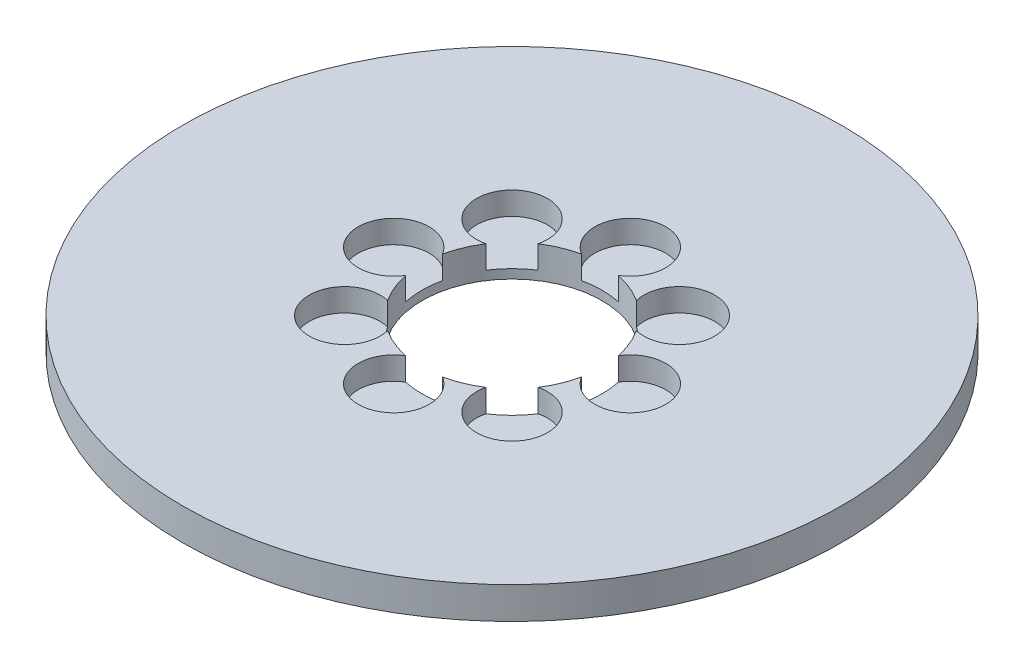
ISO-10303-21;
HEADER;
FILE_DESCRIPTION(('STEP AP214'),'2;1');
FILE_NAME('part.step','',(''),(''),'','','');
FILE_SCHEMA(('AUTOMOTIVE_DESIGN { 1 0 10303 214 1 1 1 1 }'));
ENDSEC;
DATA;
#1=APPLICATION_CONTEXT('core data for automotive mechanical design processes');
#2=APPLICATION_PROTOCOL_DEFINITION('international standard','automotive_design',2000,#1);
#3=PRODUCT_CONTEXT('',#1,'mechanical');
#4=PRODUCT('Part','Part','',(#3));
#5=PRODUCT_RELATED_PRODUCT_CATEGORY('part','',(#4));
#6=PRODUCT_DEFINITION_FORMATION('','',#4);
#7=PRODUCT_DEFINITION_CONTEXT('part definition',#1,'design');
#8=PRODUCT_DEFINITION('design','',#6,#7);
#9=PRODUCT_DEFINITION_SHAPE('','',#8);
#10=(LENGTH_UNIT() NAMED_UNIT(*) SI_UNIT(.MILLI.,.METRE.));
#11=(NAMED_UNIT(*) PLANE_ANGLE_UNIT() SI_UNIT($,.RADIAN.));
#12=(NAMED_UNIT(*) SI_UNIT($,.STERADIAN.) SOLID_ANGLE_UNIT());
#13=UNCERTAINTY_MEASURE_WITH_UNIT(LENGTH_MEASURE(1.E-05),#10,'distance_accuracy_value','');
#14=(GEOMETRIC_REPRESENTATION_CONTEXT(3) GLOBAL_UNCERTAINTY_ASSIGNED_CONTEXT((#13)) GLOBAL_UNIT_ASSIGNED_CONTEXT((#10,
#11,#12)) REPRESENTATION_CONTEXT('',''));
#15=CARTESIAN_POINT('',(0.,0.,0.));
#16=DIRECTION('',(0.,0.,1.));
#17=DIRECTION('',(1.,0.,0.));
#18=AXIS2_PLACEMENT_3D('',#15,#16,#17);
#19=CARTESIAN_POINT('',(0.,8.,0.));
#20=DIRECTION('',(0.,-1.,0.));
#21=DIRECTION('',(0.,0.,-1.));
#22=AXIS2_PLACEMENT_3D('',#19,#20,#21);
#23=CYLINDRICAL_SURFACE('',#22,82.5);
#24=CARTESIAN_POINT('',(0.,8.,0.));
#25=DIRECTION('',(0.,1.,0.));
#26=DIRECTION('',(0.,0.,1.));
#27=AXIS2_PLACEMENT_3D('',#24,#25,#26);
#28=CIRCLE('',#27,82.5);
#29=CARTESIAN_POINT('',(0.,8.,82.5));
#30=VERTEX_POINT('',#29);
#31=EDGE_CURVE('E195',#30,#30,#28,.T.);
#32=ORIENTED_EDGE('',*,*,#31,.F.);
#33=EDGE_LOOP('',(#32));
#34=FACE_BOUND('',#33,.T.);
#35=CARTESIAN_POINT('',(0.,0.,0.));
#36=DIRECTION('',(0.,1.,0.));
#37=DIRECTION('',(0.,0.,1.));
#38=AXIS2_PLACEMENT_3D('',#35,#36,#37);
#39=CIRCLE('',#38,82.5);
#40=CARTESIAN_POINT('',(0.,0.,82.5));
#41=VERTEX_POINT('',#40);
#42=EDGE_CURVE('E179',#41,#41,#39,.T.);
#43=ORIENTED_EDGE('',*,*,#42,.T.);
#44=EDGE_LOOP('',(#43));
#45=FACE_BOUND('',#44,.T.);
#46=ADVANCED_FACE('F39',(#34,#45),#23,.T.);
#47=CARTESIAN_POINT('',(0.,8.,0.));
#48=DIRECTION('',(0.,1.,0.));
#49=DIRECTION('',(0.,0.,1.));
#50=AXIS2_PLACEMENT_3D('',#47,#48,#49);
#51=PLANE('',#50);
#52=CARTESIAN_POINT('',(1.03393950551604E-13,8.,29.6132044016202));
#53=DIRECTION('',(0.,1.,0.));
#54=DIRECTION('',(1.,0.,0.));
#55=AXIS2_PLACEMENT_3D('',#52,#53,#54);
#56=CIRCLE('',#55,8.89190241130304);
#57=CARTESIAN_POINT('',(-4.62590826975477,8.,22.0193317945803));
#58=VERTEX_POINT('',#57);
#59=CARTESIAN_POINT('',(4.62590826975492,8.,22.0193317945803));
#60=VERTEX_POINT('',#59);
#61=EDGE_CURVE('E176',#58,#60,#56,.T.);
#62=ORIENTED_EDGE('',*,*,#61,.F.);
#63=CARTESIAN_POINT('',(0.,8.,0.));
#64=DIRECTION('',(0.,1.,0.));
#65=DIRECTION('',(0.,0.,1.));
#66=AXIS2_PLACEMENT_3D('',#63,#64,#65);
#67=CIRCLE('',#66,22.5);
#68=CARTESIAN_POINT('',(-12.2990077224537,8.,18.8410299358349));
#69=VERTEX_POINT('',#68);
#70=EDGE_CURVE('E166',#69,#58,#67,.T.);
#71=ORIENTED_EDGE('',*,*,#70,.F.);
#72=CARTESIAN_POINT('',(-20.9396976450489,8.,20.939697645049));
#73=DIRECTION('',(0.,1.,0.));
#74=DIRECTION('',(0.707106781186549,0.,0.707106781186546));
#75=AXIS2_PLACEMENT_3D('',#72,#73,#74);
#76=CIRCLE('',#75,8.89190241130304);
#77=CARTESIAN_POINT('',(-18.8410299358348,8.,12.2990077224537));
#78=VERTEX_POINT('',#77);
#79=EDGE_CURVE('E147',#78,#69,#76,.T.);
#80=ORIENTED_EDGE('',*,*,#79,.F.);
#81=CARTESIAN_POINT('',(-22.0193317945803,8.,4.62590826975484));
#82=VERTEX_POINT('',#81);
#83=EDGE_CURVE('E180',#82,#78,#67,.T.);
#84=ORIENTED_EDGE('',*,*,#83,.F.);
#85=CARTESIAN_POINT('',(-29.6132044016202,8.,0.));
#86=DIRECTION('',(0.,1.,0.));
#87=DIRECTION('',(0.,0.,1.));
#88=AXIS2_PLACEMENT_3D('',#85,#86,#87);
#89=CIRCLE('',#88,8.89190241130304);
#90=CARTESIAN_POINT('',(-22.0193317945803,8.,-4.62590826975484));
#91=VERTEX_POINT('',#90);
#92=EDGE_CURVE('E186',#91,#82,#89,.T.);
#93=ORIENTED_EDGE('',*,*,#92,.F.);
#94=CARTESIAN_POINT('',(-18.841029935835,8.,-12.2990077224535));
#95=VERTEX_POINT('',#94);
#96=EDGE_CURVE('E182',#95,#91,#67,.T.);
#97=ORIENTED_EDGE('',*,*,#96,.F.);
#98=CARTESIAN_POINT('',(-20.9396976450492,8.,-20.9396976450487));
#99=DIRECTION('',(0.,1.,0.));
#100=DIRECTION('',(-0.707106781186539,0.,0.707106781186556));
#101=AXIS2_PLACEMENT_3D('',#98,#99,#100);
#102=CIRCLE('',#101,8.89190241130304);
#103=CARTESIAN_POINT('',(-12.2990077224539,8.,-18.8410299358347));
#104=VERTEX_POINT('',#103);
#105=EDGE_CURVE('E446',#104,#95,#102,.T.);
#106=ORIENTED_EDGE('',*,*,#105,.F.);
#107=CARTESIAN_POINT('',(-4.62590826975508,8.,-22.0193317945802));
#108=VERTEX_POINT('',#107);
#109=EDGE_CURVE('E452',#108,#104,#67,.T.);
#110=ORIENTED_EDGE('',*,*,#109,.F.);
#111=CARTESIAN_POINT('',(-3.10181851654812E-13,8.,-29.6132044016202));
#112=DIRECTION('',(0.,1.,0.));
#113=DIRECTION('',(-1.,0.,0.));
#114=AXIS2_PLACEMENT_3D('',#111,#112,#113);
#115=CIRCLE('',#114,8.89190241130304);
#116=CARTESIAN_POINT('',(4.62590826975461,8.,-22.0193317945803));
#117=VERTEX_POINT('',#116);
#118=EDGE_CURVE('E477',#117,#108,#115,.T.);
#119=ORIENTED_EDGE('',*,*,#118,.F.);
#120=CARTESIAN_POINT('',(12.2990077224535,8.,-18.8410299358349));
#121=VERTEX_POINT('',#120);
#122=EDGE_CURVE('E460',#121,#117,#67,.T.);
#123=ORIENTED_EDGE('',*,*,#122,.F.);
#124=CARTESIAN_POINT('',(20.9396976450487,8.,-20.9396976450491));
#125=DIRECTION('',(0.,1.,0.));
#126=DIRECTION('',(-0.707106781186554,0.,-0.707106781186541));
#127=AXIS2_PLACEMENT_3D('',#124,#125,#126);
#128=CIRCLE('',#127,8.89190241130304);
#129=CARTESIAN_POINT('',(18.8410299358347,8.,-12.2990077224538));
#130=VERTEX_POINT('',#129);
#131=EDGE_CURVE('E464',#130,#121,#128,.T.);
#132=ORIENTED_EDGE('',*,*,#131,.F.);
#133=CARTESIAN_POINT('',(22.0193317945803,8.,-4.62590826975484));
#134=VERTEX_POINT('',#133);
#135=EDGE_CURVE('E459',#134,#130,#67,.T.);
#136=ORIENTED_EDGE('',*,*,#135,.F.);
#137=CARTESIAN_POINT('',(29.6132044016202,8.,0.));
#138=DIRECTION('',(0.,1.,0.));
#139=DIRECTION('',(0.,0.,-1.));
#140=AXIS2_PLACEMENT_3D('',#137,#138,#139);
#141=CIRCLE('',#140,8.89190241130304);
#142=CARTESIAN_POINT('',(22.0193317945803,8.,4.62590826975484));
#143=VERTEX_POINT('',#142);
#144=EDGE_CURVE('E469',#143,#134,#141,.T.);
#145=ORIENTED_EDGE('',*,*,#144,.F.);
#146=CARTESIAN_POINT('',(18.8410299358349,8.,12.2990077224536));
#147=VERTEX_POINT('',#146);
#148=EDGE_CURVE('E181',#147,#143,#67,.T.);
#149=ORIENTED_EDGE('',*,*,#148,.F.);
#150=CARTESIAN_POINT('',(20.939697645049,8.,20.9396976450488));
#151=DIRECTION('',(0.,1.,0.));
#152=DIRECTION('',(0.707106781186544,0.,-0.707106781186551));
#153=AXIS2_PLACEMENT_3D('',#150,#151,#152);
#154=CIRCLE('',#153,8.89190241130304);
#155=CARTESIAN_POINT('',(12.2990077224538,8.,18.8410299358348));
#156=VERTEX_POINT('',#155);
#157=EDGE_CURVE('E475',#156,#147,#154,.T.);
#158=ORIENTED_EDGE('',*,*,#157,.F.);
#159=EDGE_CURVE('E177',#60,#156,#67,.T.);
#160=ORIENTED_EDGE('',*,*,#159,.F.);
#161=EDGE_LOOP('',(#62,#71,#80,#84,#93,#97,#106,#110,#119,#123,#132,#136,#145,#149,#158,#160));
#162=FACE_BOUND('',#161,.T.);
#163=ORIENTED_EDGE('',*,*,#31,.T.);
#164=EDGE_LOOP('',(#163));
#165=FACE_BOUND('',#164,.T.);
#166=ADVANCED_FACE('F172',(#162,#165),#51,.T.);
#167=CARTESIAN_POINT('',(0.,0.,0.));
#168=DIRECTION('',(0.,1.,0.));
#169=DIRECTION('',(0.,0.,1.));
#170=AXIS2_PLACEMENT_3D('',#167,#168,#169);
#171=PLANE('',#170);
#172=CARTESIAN_POINT('',(0.,0.,0.));
#173=DIRECTION('',(0.,1.,0.));
#174=DIRECTION('',(0.,0.,1.));
#175=AXIS2_PLACEMENT_3D('',#172,#173,#174);
#176=CIRCLE('',#175,22.5);
#177=CARTESIAN_POINT('',(0.,0.,22.5));
#178=VERTEX_POINT('',#177);
#179=EDGE_CURVE('E187',#178,#178,#176,.T.);
#180=ORIENTED_EDGE('',*,*,#179,.T.);
#181=EDGE_LOOP('',(#180));
#182=FACE_BOUND('',#181,.T.);
#183=ORIENTED_EDGE('',*,*,#42,.F.);
#184=EDGE_LOOP('',(#183));
#185=FACE_BOUND('',#184,.T.);
#186=ADVANCED_FACE('F270',(#182,#185),#171,.F.);
#187=CARTESIAN_POINT('',(0.,8.,0.));
#188=DIRECTION('',(0.,-1.,0.));
#189=DIRECTION('',(0.,0.,-1.));
#190=AXIS2_PLACEMENT_3D('',#187,#188,#189);
#191=CYLINDRICAL_SURFACE('',#190,22.5);
#192=DIRECTION('',(0.,1.,0.));
#193=VECTOR('',#192,1.);
#194=CARTESIAN_POINT('',(-4.62590826975476,5.13421334792571,22.0193317945803));
#195=LINE('',#194,#193);
#196=CARTESIAN_POINT('',(-4.62590826975477,2.26842669585141,22.0193317945803));
#197=VERTEX_POINT('',#196);
#198=EDGE_CURVE('E11',#197,#58,#195,.T.);
#199=ORIENTED_EDGE('',*,*,#198,.F.);
#200=CARTESIAN_POINT('',(0.,2.26842669585141,0.));
#201=DIRECTION('',(0.,1.,0.));
#202=DIRECTION('',(0.,0.,1.));
#203=AXIS2_PLACEMENT_3D('',#200,#201,#202);
#204=CIRCLE('',#203,22.5);
#205=CARTESIAN_POINT('',(4.62590826975492,2.26842669585141,22.0193317945803));
#206=VERTEX_POINT('',#205);
#207=EDGE_CURVE('E250',#197,#206,#204,.T.);
#208=ORIENTED_EDGE('',*,*,#207,.T.);
#209=DIRECTION('',(0.,1.,0.));
#210=VECTOR('',#209,1.);
#211=CARTESIAN_POINT('',(4.62590826975492,5.13421334792571,22.0193317945803));
#212=LINE('',#211,#210);
#213=EDGE_CURVE('E46',#60,#206,#212,.F.);
#214=ORIENTED_EDGE('',*,*,#213,.F.);
#215=ORIENTED_EDGE('',*,*,#159,.T.);
#216=DIRECTION('',(0.,1.,0.));
#217=VECTOR('',#216,1.);
#218=CARTESIAN_POINT('',(12.2990077224538,5.13421334792571,18.8410299358348));
#219=LINE('',#218,#217);
#220=CARTESIAN_POINT('',(12.2990077224538,2.26842669585141,18.8410299358348));
#221=VERTEX_POINT('',#220);
#222=EDGE_CURVE('E244',#221,#156,#219,.T.);
#223=ORIENTED_EDGE('',*,*,#222,.F.);
#224=CARTESIAN_POINT('',(0.,2.26842669585141,0.));
#225=DIRECTION('',(0.,1.,0.));
#226=DIRECTION('',(0.,0.,1.));
#227=AXIS2_PLACEMENT_3D('',#224,#225,#226);
#228=CIRCLE('',#227,22.5);
#229=CARTESIAN_POINT('',(18.8410299358349,2.26842669585141,12.2990077224536));
#230=VERTEX_POINT('',#229);
#231=EDGE_CURVE('E238',#221,#230,#228,.T.);
#232=ORIENTED_EDGE('',*,*,#231,.T.);
#233=DIRECTION('',(0.,1.,0.));
#234=VECTOR('',#233,1.);
#235=CARTESIAN_POINT('',(18.8410299358349,5.13421334792571,12.2990077224536));
#236=LINE('',#235,#234);
#237=EDGE_CURVE('E242',#147,#230,#236,.F.);
#238=ORIENTED_EDGE('',*,*,#237,.F.);
#239=ORIENTED_EDGE('',*,*,#148,.T.);
#240=DIRECTION('',(0.,1.,0.));
#241=VECTOR('',#240,1.);
#242=CARTESIAN_POINT('',(22.0193317945803,5.13421334792571,4.62590826975484));
#243=LINE('',#242,#241);
#244=CARTESIAN_POINT('',(22.0193317945803,2.26842669585141,4.62590826975484));
#245=VERTEX_POINT('',#244);
#246=EDGE_CURVE('E236',#245,#143,#243,.T.);
#247=ORIENTED_EDGE('',*,*,#246,.F.);
#248=CARTESIAN_POINT('',(0.,2.26842669585141,0.));
#249=DIRECTION('',(0.,1.,0.));
#250=DIRECTION('',(0.,0.,1.));
#251=AXIS2_PLACEMENT_3D('',#248,#249,#250);
#252=CIRCLE('',#251,22.5);
#253=CARTESIAN_POINT('',(22.0193317945803,2.26842669585141,-4.62590826975484));
#254=VERTEX_POINT('',#253);
#255=EDGE_CURVE('E235',#245,#254,#252,.T.);
#256=ORIENTED_EDGE('',*,*,#255,.T.);
#257=DIRECTION('',(0.,1.,0.));
#258=VECTOR('',#257,1.);
#259=CARTESIAN_POINT('',(22.0193317945803,5.13421334792571,-4.62590826975484));
#260=LINE('',#259,#258);
#261=EDGE_CURVE('E234',#134,#254,#260,.F.);
#262=ORIENTED_EDGE('',*,*,#261,.F.);
#263=ORIENTED_EDGE('',*,*,#135,.T.);
#264=DIRECTION('',(0.,1.,0.));
#265=VECTOR('',#264,1.);
#266=CARTESIAN_POINT('',(18.8410299358347,5.13421334792571,-12.2990077224539));
#267=LINE('',#266,#265);
#268=CARTESIAN_POINT('',(18.8410299358347,2.26842669585141,-12.2990077224538));
#269=VERTEX_POINT('',#268);
#270=EDGE_CURVE('E229',#269,#130,#267,.T.);
#271=ORIENTED_EDGE('',*,*,#270,.F.);
#272=CARTESIAN_POINT('',(0.,2.26842669585141,0.));
#273=DIRECTION('',(0.,1.,0.));
#274=DIRECTION('',(0.,0.,1.));
#275=AXIS2_PLACEMENT_3D('',#272,#273,#274);
#276=CIRCLE('',#275,22.5);
#277=CARTESIAN_POINT('',(12.2990077224535,2.26842669585141,-18.8410299358349));
#278=VERTEX_POINT('',#277);
#279=EDGE_CURVE('E221',#269,#278,#276,.T.);
#280=ORIENTED_EDGE('',*,*,#279,.T.);
#281=DIRECTION('',(0.,1.,0.));
#282=VECTOR('',#281,1.);
#283=CARTESIAN_POINT('',(12.2990077224535,5.13421334792571,-18.8410299358349));
#284=LINE('',#283,#282);
#285=EDGE_CURVE('E230',#121,#278,#284,.F.);
#286=ORIENTED_EDGE('',*,*,#285,.F.);
#287=ORIENTED_EDGE('',*,*,#122,.T.);
#288=DIRECTION('',(0.,1.,0.));
#289=VECTOR('',#288,1.);
#290=CARTESIAN_POINT('',(4.62590826975461,5.13421334792571,-22.0193317945803));
#291=LINE('',#290,#289);
#292=CARTESIAN_POINT('',(4.62590826975461,2.26842669585141,-22.0193317945803));
#293=VERTEX_POINT('',#292);
#294=EDGE_CURVE('E225',#293,#117,#291,.T.);
#295=ORIENTED_EDGE('',*,*,#294,.F.);
#296=CARTESIAN_POINT('',(0.,2.26842669585141,0.));
#297=DIRECTION('',(0.,1.,0.));
#298=DIRECTION('',(0.,0.,1.));
#299=AXIS2_PLACEMENT_3D('',#296,#297,#298);
#300=CIRCLE('',#299,22.5);
#301=CARTESIAN_POINT('',(-4.62590826975508,2.26842669585141,-22.0193317945802));
#302=VERTEX_POINT('',#301);
#303=EDGE_CURVE('E216',#293,#302,#300,.T.);
#304=ORIENTED_EDGE('',*,*,#303,.T.);
#305=DIRECTION('',(0.,1.,0.));
#306=VECTOR('',#305,1.);
#307=CARTESIAN_POINT('',(-4.62590826975507,5.13421334792571,-22.0193317945802));
#308=LINE('',#307,#306);
#309=EDGE_CURVE('E218',#108,#302,#308,.F.);
#310=ORIENTED_EDGE('',*,*,#309,.F.);
#311=ORIENTED_EDGE('',*,*,#109,.T.);
#312=DIRECTION('',(0.,1.,0.));
#313=VECTOR('',#312,1.);
#314=CARTESIAN_POINT('',(-12.2990077224539,5.13421334792571,-18.8410299358347));
#315=LINE('',#314,#313);
#316=CARTESIAN_POINT('',(-12.2990077224539,2.26842669585141,-18.8410299358347));
#317=VERTEX_POINT('',#316);
#318=EDGE_CURVE('E212',#317,#104,#315,.T.);
#319=ORIENTED_EDGE('',*,*,#318,.F.);
#320=CARTESIAN_POINT('',(0.,2.26842669585141,0.));
#321=DIRECTION('',(0.,1.,0.));
#322=DIRECTION('',(0.,0.,1.));
#323=AXIS2_PLACEMENT_3D('',#320,#321,#322);
#324=CIRCLE('',#323,22.5);
#325=CARTESIAN_POINT('',(-18.841029935835,2.26842669585141,-12.2990077224535));
#326=VERTEX_POINT('',#325);
#327=EDGE_CURVE('E208',#317,#326,#324,.T.);
#328=ORIENTED_EDGE('',*,*,#327,.T.);
#329=DIRECTION('',(0.,1.,0.));
#330=VECTOR('',#329,1.);
#331=CARTESIAN_POINT('',(-18.841029935835,5.13421334792571,-12.2990077224535));
#332=LINE('',#331,#330);
#333=EDGE_CURVE('E211',#95,#326,#332,.F.);
#334=ORIENTED_EDGE('',*,*,#333,.F.);
#335=ORIENTED_EDGE('',*,*,#96,.T.);
#336=DIRECTION('',(0.,1.,0.));
#337=VECTOR('',#336,1.);
#338=CARTESIAN_POINT('',(-22.0193317945803,5.13421334792571,-4.62590826975484));
#339=LINE('',#338,#337);
#340=CARTESIAN_POINT('',(-22.0193317945803,2.26842669585141,-4.62590826975484));
#341=VERTEX_POINT('',#340);
#342=EDGE_CURVE('E201',#341,#91,#339,.T.);
#343=ORIENTED_EDGE('',*,*,#342,.F.);
#344=CARTESIAN_POINT('',(0.,2.26842669585141,0.));
#345=DIRECTION('',(0.,1.,0.));
#346=DIRECTION('',(0.,0.,1.));
#347=AXIS2_PLACEMENT_3D('',#344,#345,#346);
#348=CIRCLE('',#347,22.5);
#349=CARTESIAN_POINT('',(-22.0193317945803,2.26842669585141,4.62590826975484));
#350=VERTEX_POINT('',#349);
#351=EDGE_CURVE('E194',#341,#350,#348,.T.);
#352=ORIENTED_EDGE('',*,*,#351,.T.);
#353=DIRECTION('',(0.,1.,0.));
#354=VECTOR('',#353,1.);
#355=CARTESIAN_POINT('',(-22.0193317945803,5.13421334792571,4.62590826975484));
#356=LINE('',#355,#354);
#357=EDGE_CURVE('E199',#82,#350,#356,.F.);
#358=ORIENTED_EDGE('',*,*,#357,.F.);
#359=ORIENTED_EDGE('',*,*,#83,.T.);
#360=DIRECTION('',(0.,1.,0.));
#361=VECTOR('',#360,1.);
#362=CARTESIAN_POINT('',(-18.8410299358348,5.13421334792571,12.2990077224537));
#363=LINE('',#362,#361);
#364=CARTESIAN_POINT('',(-18.8410299358348,2.26842669585141,12.2990077224537));
#365=VERTEX_POINT('',#364);
#366=EDGE_CURVE('E160',#365,#78,#363,.T.);
#367=ORIENTED_EDGE('',*,*,#366,.F.);
#368=CARTESIAN_POINT('',(0.,2.26842669585141,0.));
#369=DIRECTION('',(0.,1.,0.));
#370=DIRECTION('',(0.,0.,1.));
#371=AXIS2_PLACEMENT_3D('',#368,#369,#370);
#372=CIRCLE('',#371,22.5);
#373=CARTESIAN_POINT('',(-12.2990077224537,2.26842669585141,18.8410299358349));
#374=VERTEX_POINT('',#373);
#375=EDGE_CURVE('E168',#365,#374,#372,.T.);
#376=ORIENTED_EDGE('',*,*,#375,.T.);
#377=DIRECTION('',(0.,1.,0.));
#378=VECTOR('',#377,1.);
#379=CARTESIAN_POINT('',(-12.2990077224537,5.13421334792571,18.8410299358348));
#380=LINE('',#379,#378);
#381=EDGE_CURVE('E152',#69,#374,#380,.F.);
#382=ORIENTED_EDGE('',*,*,#381,.F.);
#383=ORIENTED_EDGE('',*,*,#70,.T.);
#384=EDGE_LOOP('',(#199,#208,#214,#215,#223,#232,#238,#239,#247,#256,#262,#263,#271,#280,#286,
#287,#295,#304,#310,#311,#319,#328,#334,#335,#343,#352,#358,#359,#367,#376,#382,#383));
#385=FACE_BOUND('',#384,.T.);
#386=ORIENTED_EDGE('',*,*,#179,.F.);
#387=EDGE_LOOP('',(#386));
#388=FACE_BOUND('',#387,.T.);
#389=ADVANCED_FACE('F170',(#385,#388),#191,.F.);
#390=CARTESIAN_POINT('',(-29.6132044016202,2.26842669585141,0.));
#391=DIRECTION('',(0.,1.,0.));
#392=DIRECTION('',(0.,0.,1.));
#393=AXIS2_PLACEMENT_3D('',#390,#391,#392);
#394=CYLINDRICAL_SURFACE('',#393,8.89190241130304);
#395=ORIENTED_EDGE('',*,*,#342,.T.);
#396=ORIENTED_EDGE('',*,*,#92,.T.);
#397=ORIENTED_EDGE('',*,*,#357,.T.);
#398=CARTESIAN_POINT('',(-29.6132044016202,2.26842669585141,0.));
#399=DIRECTION('',(0.,1.,0.));
#400=DIRECTION('',(0.,0.,1.));
#401=AXIS2_PLACEMENT_3D('',#398,#399,#400);
#402=CIRCLE('',#401,8.89190241130304);
#403=EDGE_CURVE('E191',#341,#350,#402,.T.);
#404=ORIENTED_EDGE('',*,*,#403,.F.);
#405=EDGE_LOOP('',(#395,#396,#397,#404));
#406=FACE_BOUND('',#405,.T.);
#407=ADVANCED_FACE('F279',(#406),#394,.F.);
#408=CARTESIAN_POINT('',(-29.6132044016202,2.26842669585141,0.));
#409=DIRECTION('',(0.,1.,0.));
#410=DIRECTION('',(0.,0.,1.));
#411=AXIS2_PLACEMENT_3D('',#408,#409,#410);
#412=PLANE('',#411);
#413=ORIENTED_EDGE('',*,*,#403,.T.);
#414=ORIENTED_EDGE('',*,*,#351,.F.);
#415=EDGE_LOOP('',(#413,#414));
#416=FACE_BOUND('',#415,.T.);
#417=ADVANCED_FACE('F285',(#416),#412,.T.);
#418=CARTESIAN_POINT('',(-20.9396976450489,2.26842669585141,20.939697645049));
#419=DIRECTION('',(0.,1.,0.));
#420=DIRECTION('',(0.,0.,1.));
#421=AXIS2_PLACEMENT_3D('',#418,#419,#420);
#422=CYLINDRICAL_SURFACE('',#421,8.89190241130304);
#423=ORIENTED_EDGE('',*,*,#366,.T.);
#424=ORIENTED_EDGE('',*,*,#79,.T.);
#425=ORIENTED_EDGE('',*,*,#381,.T.);
#426=CARTESIAN_POINT('',(-20.9396976450489,2.26842669585141,20.939697645049));
#427=DIRECTION('',(0.,1.,0.));
#428=DIRECTION('',(0.707106781186549,0.,0.707106781186546));
#429=AXIS2_PLACEMENT_3D('',#426,#427,#428);
#430=CIRCLE('',#429,8.89190241130304);
#431=EDGE_CURVE('E165',#365,#374,#430,.T.);
#432=ORIENTED_EDGE('',*,*,#431,.F.);
#433=EDGE_LOOP('',(#423,#424,#425,#432));
#434=FACE_BOUND('',#433,.T.);
#435=ADVANCED_FACE('F155',(#434),#422,.F.);
#436=CARTESIAN_POINT('',(-20.9396976450489,2.26842669585141,20.939697645049));
#437=DIRECTION('',(0.,1.,0.));
#438=DIRECTION('',(0.707106781186549,0.,0.707106781186546));
#439=AXIS2_PLACEMENT_3D('',#436,#437,#438);
#440=PLANE('',#439);
#441=ORIENTED_EDGE('',*,*,#431,.T.);
#442=ORIENTED_EDGE('',*,*,#375,.F.);
#443=EDGE_LOOP('',(#441,#442));
#444=FACE_BOUND('',#443,.T.);
#445=ADVANCED_FACE('F288',(#444),#440,.T.);
#446=CARTESIAN_POINT('',(-20.9396976450492,2.26842669585141,-20.9396976450487));
#447=DIRECTION('',(0.,1.,0.));
#448=DIRECTION('',(0.,0.,1.));
#449=AXIS2_PLACEMENT_3D('',#446,#447,#448);
#450=CYLINDRICAL_SURFACE('',#449,8.89190241130304);
#451=ORIENTED_EDGE('',*,*,#318,.T.);
#452=ORIENTED_EDGE('',*,*,#105,.T.);
#453=ORIENTED_EDGE('',*,*,#333,.T.);
#454=CARTESIAN_POINT('',(-20.9396976450492,2.26842669585141,-20.9396976450487));
#455=DIRECTION('',(0.,1.,0.));
#456=DIRECTION('',(-0.707106781186539,0.,0.707106781186556));
#457=AXIS2_PLACEMENT_3D('',#454,#455,#456);
#458=CIRCLE('',#457,8.89190241130304);
#459=EDGE_CURVE('E447',#317,#326,#458,.T.);
#460=ORIENTED_EDGE('',*,*,#459,.F.);
#461=EDGE_LOOP('',(#451,#452,#453,#460));
#462=FACE_BOUND('',#461,.T.);
#463=ADVANCED_FACE('F295',(#462),#450,.F.);
#464=CARTESIAN_POINT('',(-20.9396976450492,2.26842669585141,-20.9396976450487));
#465=DIRECTION('',(0.,1.,0.));
#466=DIRECTION('',(-0.707106781186539,0.,0.707106781186556));
#467=AXIS2_PLACEMENT_3D('',#464,#465,#466);
#468=PLANE('',#467);
#469=ORIENTED_EDGE('',*,*,#459,.T.);
#470=ORIENTED_EDGE('',*,*,#327,.F.);
#471=EDGE_LOOP('',(#469,#470));
#472=FACE_BOUND('',#471,.T.);
#473=ADVANCED_FACE('F375',(#472),#468,.T.);
#474=CARTESIAN_POINT('',(-3.10181851654812E-13,2.26842669585141,-29.6132044016202));
#475=DIRECTION('',(0.,1.,0.));
#476=DIRECTION('',(0.,0.,1.));
#477=AXIS2_PLACEMENT_3D('',#474,#475,#476);
#478=CYLINDRICAL_SURFACE('',#477,8.89190241130304);
#479=ORIENTED_EDGE('',*,*,#294,.T.);
#480=ORIENTED_EDGE('',*,*,#118,.T.);
#481=ORIENTED_EDGE('',*,*,#309,.T.);
#482=CARTESIAN_POINT('',(-3.10181851654812E-13,2.26842669585141,-29.6132044016202));
#483=DIRECTION('',(0.,1.,0.));
#484=DIRECTION('',(-1.,0.,0.));
#485=AXIS2_PLACEMENT_3D('',#482,#483,#484);
#486=CIRCLE('',#485,8.89190241130304);
#487=EDGE_CURVE('E467',#293,#302,#486,.T.);
#488=ORIENTED_EDGE('',*,*,#487,.F.);
#489=EDGE_LOOP('',(#479,#480,#481,#488));
#490=FACE_BOUND('',#489,.T.);
#491=ADVANCED_FACE('F361',(#490),#478,.F.);
#492=CARTESIAN_POINT('',(-3.10181851654812E-13,2.26842669585141,-29.6132044016202));
#493=DIRECTION('',(0.,1.,0.));
#494=DIRECTION('',(-1.,0.,0.));
#495=AXIS2_PLACEMENT_3D('',#492,#493,#494);
#496=PLANE('',#495);
#497=ORIENTED_EDGE('',*,*,#487,.T.);
#498=ORIENTED_EDGE('',*,*,#303,.F.);
#499=EDGE_LOOP('',(#497,#498));
#500=FACE_BOUND('',#499,.T.);
#501=ADVANCED_FACE('F297',(#500),#496,.T.);
#502=CARTESIAN_POINT('',(20.9396976450487,2.26842669585141,-20.9396976450491));
#503=DIRECTION('',(0.,1.,0.));
#504=DIRECTION('',(0.,0.,1.));
#505=AXIS2_PLACEMENT_3D('',#502,#503,#504);
#506=CYLINDRICAL_SURFACE('',#505,8.89190241130304);
#507=ORIENTED_EDGE('',*,*,#270,.T.);
#508=ORIENTED_EDGE('',*,*,#131,.T.);
#509=ORIENTED_EDGE('',*,*,#285,.T.);
#510=CARTESIAN_POINT('',(20.9396976450487,2.26842669585141,-20.9396976450491));
#511=DIRECTION('',(0.,1.,0.));
#512=DIRECTION('',(-0.707106781186554,0.,-0.707106781186541));
#513=AXIS2_PLACEMENT_3D('',#510,#511,#512);
#514=CIRCLE('',#513,8.89190241130304);
#515=EDGE_CURVE('E470',#269,#278,#514,.T.);
#516=ORIENTED_EDGE('',*,*,#515,.F.);
#517=EDGE_LOOP('',(#507,#508,#509,#516));
#518=FACE_BOUND('',#517,.T.);
#519=ADVANCED_FACE('F294',(#518),#506,.F.);
#520=CARTESIAN_POINT('',(20.9396976450487,2.26842669585141,-20.9396976450491));
#521=DIRECTION('',(0.,1.,0.));
#522=DIRECTION('',(-0.707106781186554,0.,-0.707106781186541));
#523=AXIS2_PLACEMENT_3D('',#520,#521,#522);
#524=PLANE('',#523);
#525=ORIENTED_EDGE('',*,*,#515,.T.);
#526=ORIENTED_EDGE('',*,*,#279,.F.);
#527=EDGE_LOOP('',(#525,#526));
#528=FACE_BOUND('',#527,.T.);
#529=ADVANCED_FACE('F300',(#528),#524,.T.);
#530=CARTESIAN_POINT('',(29.6132044016202,2.26842669585141,0.));
#531=DIRECTION('',(0.,1.,0.));
#532=DIRECTION('',(0.,0.,1.));
#533=AXIS2_PLACEMENT_3D('',#530,#531,#532);
#534=CYLINDRICAL_SURFACE('',#533,8.89190241130304);
#535=ORIENTED_EDGE('',*,*,#246,.T.);
#536=ORIENTED_EDGE('',*,*,#144,.T.);
#537=ORIENTED_EDGE('',*,*,#261,.T.);
#538=CARTESIAN_POINT('',(29.6132044016202,2.26842669585141,0.));
#539=DIRECTION('',(0.,1.,0.));
#540=DIRECTION('',(0.,0.,-1.));
#541=AXIS2_PLACEMENT_3D('',#538,#539,#540);
#542=CIRCLE('',#541,8.89190241130304);
#543=EDGE_CURVE('E472',#245,#254,#542,.T.);
#544=ORIENTED_EDGE('',*,*,#543,.F.);
#545=EDGE_LOOP('',(#535,#536,#537,#544));
#546=FACE_BOUND('',#545,.T.);
#547=ADVANCED_FACE('F305',(#546),#534,.F.);
#548=CARTESIAN_POINT('',(29.6132044016202,2.26842669585141,0.));
#549=DIRECTION('',(0.,1.,0.));
#550=DIRECTION('',(0.,0.,-1.));
#551=AXIS2_PLACEMENT_3D('',#548,#549,#550);
#552=PLANE('',#551);
#553=ORIENTED_EDGE('',*,*,#543,.T.);
#554=ORIENTED_EDGE('',*,*,#255,.F.);
#555=EDGE_LOOP('',(#553,#554));
#556=FACE_BOUND('',#555,.T.);
#557=ADVANCED_FACE('F308',(#556),#552,.T.);
#558=CARTESIAN_POINT('',(20.939697645049,2.26842669585141,20.9396976450488));
#559=DIRECTION('',(0.,1.,0.));
#560=DIRECTION('',(0.,0.,1.));
#561=AXIS2_PLACEMENT_3D('',#558,#559,#560);
#562=CYLINDRICAL_SURFACE('',#561,8.89190241130304);
#563=ORIENTED_EDGE('',*,*,#222,.T.);
#564=ORIENTED_EDGE('',*,*,#157,.T.);
#565=ORIENTED_EDGE('',*,*,#237,.T.);
#566=CARTESIAN_POINT('',(20.939697645049,2.26842669585141,20.9396976450488));
#567=DIRECTION('',(0.,1.,0.));
#568=DIRECTION('',(0.707106781186544,0.,-0.707106781186551));
#569=AXIS2_PLACEMENT_3D('',#566,#567,#568);
#570=CIRCLE('',#569,8.89190241130304);
#571=EDGE_CURVE('E56',#221,#230,#570,.T.);
#572=ORIENTED_EDGE('',*,*,#571,.F.);
#573=EDGE_LOOP('',(#563,#564,#565,#572));
#574=FACE_BOUND('',#573,.T.);
#575=ADVANCED_FACE('F309',(#574),#562,.F.);
#576=CARTESIAN_POINT('',(20.939697645049,2.26842669585141,20.9396976450488));
#577=DIRECTION('',(0.,1.,0.));
#578=DIRECTION('',(0.707106781186544,0.,-0.707106781186551));
#579=AXIS2_PLACEMENT_3D('',#576,#577,#578);
#580=PLANE('',#579);
#581=ORIENTED_EDGE('',*,*,#571,.T.);
#582=ORIENTED_EDGE('',*,*,#231,.F.);
#583=EDGE_LOOP('',(#581,#582));
#584=FACE_BOUND('',#583,.T.);
#585=ADVANCED_FACE('F256',(#584),#580,.T.);
#586=CARTESIAN_POINT('',(1.03393950551604E-13,2.26842669585141,29.6132044016202));
#587=DIRECTION('',(0.,1.,0.));
#588=DIRECTION('',(0.,0.,1.));
#589=AXIS2_PLACEMENT_3D('',#586,#587,#588);
#590=CYLINDRICAL_SURFACE('',#589,8.89190241130304);
#591=ORIENTED_EDGE('',*,*,#198,.T.);
#592=ORIENTED_EDGE('',*,*,#61,.T.);
#593=ORIENTED_EDGE('',*,*,#213,.T.);
#594=CARTESIAN_POINT('',(1.03393950551604E-13,2.26842669585141,29.6132044016202));
#595=DIRECTION('',(0.,1.,0.));
#596=DIRECTION('',(1.,0.,0.));
#597=AXIS2_PLACEMENT_3D('',#594,#595,#596);
#598=CIRCLE('',#597,8.89190241130304);
#599=EDGE_CURVE('E55',#197,#206,#598,.T.);
#600=ORIENTED_EDGE('',*,*,#599,.F.);
#601=EDGE_LOOP('',(#591,#592,#593,#600));
#602=FACE_BOUND('',#601,.T.);
#603=ADVANCED_FACE('F253',(#602),#590,.F.);
#604=CARTESIAN_POINT('',(1.03393950551604E-13,2.26842669585141,29.6132044016202));
#605=DIRECTION('',(0.,1.,0.));
#606=DIRECTION('',(1.,0.,0.));
#607=AXIS2_PLACEMENT_3D('',#604,#605,#606);
#608=PLANE('',#607);
#609=ORIENTED_EDGE('',*,*,#599,.T.);
#610=ORIENTED_EDGE('',*,*,#207,.F.);
#611=EDGE_LOOP('',(#609,#610));
#612=FACE_BOUND('',#611,.T.);
#613=ADVANCED_FACE('F252',(#612),#608,.T.);
#614=CLOSED_SHELL('',(#46,#166,#186,#389,#407,#417,#435,#445,#463,#473,#491,#501,#519,#529,#547,
#557,#575,#585,#603,#613));
#615=MANIFOLD_SOLID_BREP('B2',#614);
#616=ADVANCED_BREP_SHAPE_REPRESENTATION('',(#18,#615),#14);
#617=SHAPE_DEFINITION_REPRESENTATION(#9,#616);
ENDSEC;
END-ISO-10303-21;
